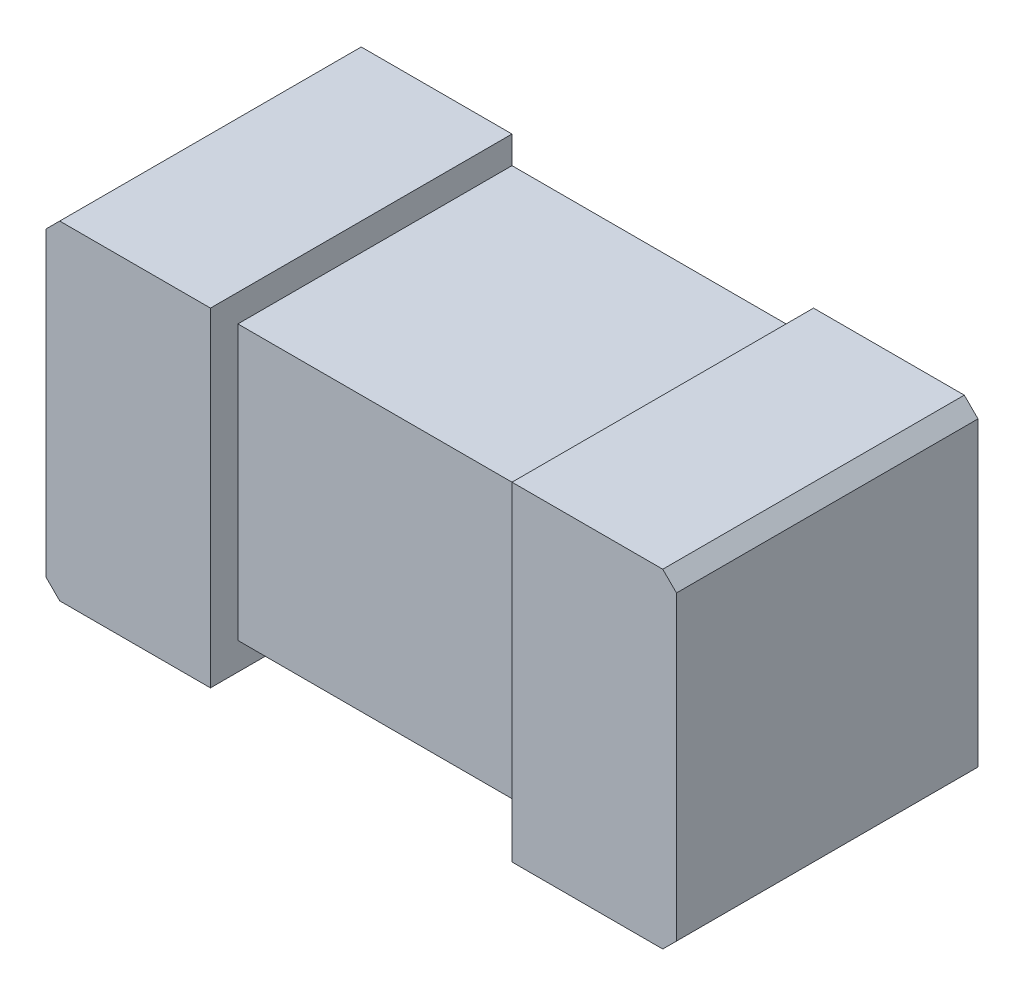
ISO-10303-21;
HEADER;
FILE_DESCRIPTION(('STEP AP214'),'2;1');
FILE_NAME('part.step','',(''),(''),'','','');
FILE_SCHEMA(('AUTOMOTIVE_DESIGN { 1 0 10303 214 1 1 1 1 }'));
ENDSEC;
DATA;
#1=APPLICATION_CONTEXT('core data for automotive mechanical design processes');
#2=APPLICATION_PROTOCOL_DEFINITION('international standard','automotive_design',2000,#1);
#3=PRODUCT_CONTEXT('',#1,'mechanical');
#4=PRODUCT('Part','Part','',(#3));
#5=PRODUCT_RELATED_PRODUCT_CATEGORY('part','',(#4));
#6=PRODUCT_DEFINITION_FORMATION('','',#4);
#7=PRODUCT_DEFINITION_CONTEXT('part definition',#1,'design');
#8=PRODUCT_DEFINITION('design','',#6,#7);
#9=PRODUCT_DEFINITION_SHAPE('','',#8);
#10=(LENGTH_UNIT() NAMED_UNIT(*) SI_UNIT(.MILLI.,.METRE.));
#11=(NAMED_UNIT(*) PLANE_ANGLE_UNIT() SI_UNIT($,.RADIAN.));
#12=(NAMED_UNIT(*) SI_UNIT($,.STERADIAN.) SOLID_ANGLE_UNIT());
#13=UNCERTAINTY_MEASURE_WITH_UNIT(LENGTH_MEASURE(1.E-05),#10,'distance_accuracy_value','');
#14=(GEOMETRIC_REPRESENTATION_CONTEXT(3) GLOBAL_UNCERTAINTY_ASSIGNED_CONTEXT((#13)) GLOBAL_UNIT_ASSIGNED_CONTEXT((#10,
#11,#12)) REPRESENTATION_CONTEXT('',''));
#15=CARTESIAN_POINT('',(0.,0.,0.));
#16=DIRECTION('',(0.,0.,1.));
#17=DIRECTION('',(1.,0.,0.));
#18=AXIS2_PLACEMENT_3D('',#15,#16,#17);
#19=CARTESIAN_POINT('',(0.,0.85,0.55));
#20=DIRECTION('',(0.,0.,1.));
#21=DIRECTION('',(1.,0.,0.));
#22=AXIS2_PLACEMENT_3D('',#19,#20,#21);
#23=PLANE('',#22);
#24=DIRECTION('',(0.,1.,0.));
#25=VECTOR('',#24,1.);
#26=CARTESIAN_POINT('',(0.275,0.25,0.55));
#27=LINE('',#26,#25);
#28=CARTESIAN_POINT('',(0.275,-0.3,0.55));
#29=VERTEX_POINT('',#28);
#30=CARTESIAN_POINT('',(0.275,0.3,0.55));
#31=VERTEX_POINT('',#30);
#32=EDGE_CURVE('E43',#29,#31,#27,.T.);
#33=ORIENTED_EDGE('',*,*,#32,.F.);
#34=DIRECTION('',(1.,0.,0.));
#35=VECTOR('',#34,1.);
#36=CARTESIAN_POINT('',(-0.55,-0.3,0.55));
#37=LINE('',#36,#35);
#38=CARTESIAN_POINT('',(0.55,-0.3,0.55));
#39=VERTEX_POINT('',#38);
#40=EDGE_CURVE('E11',#29,#39,#37,.T.);
#41=ORIENTED_EDGE('',*,*,#40,.T.);
#42=DIRECTION('',(0.707106781186548,0.707106781186548,0.));
#43=VECTOR('',#42,1.);
#44=CARTESIAN_POINT('',(0.55,-0.3,0.55));
#45=LINE('',#44,#43);
#46=CARTESIAN_POINT('',(0.575,-0.275,0.55));
#47=VERTEX_POINT('',#46);
#48=EDGE_CURVE('E29',#39,#47,#45,.T.);
#49=ORIENTED_EDGE('',*,*,#48,.T.);
#50=DIRECTION('',(0.,1.,0.));
#51=VECTOR('',#50,1.);
#52=CARTESIAN_POINT('',(0.575,-0.275,0.55));
#53=LINE('',#52,#51);
#54=CARTESIAN_POINT('',(0.575,0.275,0.55));
#55=VERTEX_POINT('',#54);
#56=EDGE_CURVE('E247',#47,#55,#53,.T.);
#57=ORIENTED_EDGE('',*,*,#56,.T.);
#58=DIRECTION('',(-0.707106781186548,0.707106781186548,0.));
#59=VECTOR('',#58,1.);
#60=CARTESIAN_POINT('',(0.575,0.275,0.55));
#61=LINE('',#60,#59);
#62=CARTESIAN_POINT('',(0.55,0.3,0.55));
#63=VERTEX_POINT('',#62);
#64=EDGE_CURVE('E252',#55,#63,#61,.T.);
#65=ORIENTED_EDGE('',*,*,#64,.T.);
#66=DIRECTION('',(-1.,0.,0.));
#67=VECTOR('',#66,1.);
#68=CARTESIAN_POINT('',(0.55,0.3,0.55));
#69=LINE('',#68,#67);
#70=EDGE_CURVE('E154',#63,#31,#69,.T.);
#71=ORIENTED_EDGE('',*,*,#70,.T.);
#72=EDGE_LOOP('',(#33,#41,#49,#57,#65,#71));
#73=FACE_BOUND('',#72,.T.);
#74=ADVANCED_FACE('F18',(#73),#23,.T.);
#75=CARTESIAN_POINT('',(-0.55,-0.3,0.55));
#76=DIRECTION('',(0.,1.,0.));
#77=DIRECTION('',(1.,0.,0.));
#78=AXIS2_PLACEMENT_3D('',#75,#76,#77);
#79=PLANE('',#78);
#80=DIRECTION('',(1.,0.,0.));
#81=VECTOR('',#80,1.);
#82=CARTESIAN_POINT('',(-0.55,-0.3,0.));
#83=LINE('',#82,#81);
#84=CARTESIAN_POINT('',(-0.55,-0.3,0.));
#85=VERTEX_POINT('',#84);
#86=CARTESIAN_POINT('',(-0.275,-0.3,0.));
#87=VERTEX_POINT('',#86);
#88=EDGE_CURVE('E262',#85,#87,#83,.T.);
#89=ORIENTED_EDGE('',*,*,#88,.T.);
#90=DIRECTION('',(0.,0.,1.));
#91=VECTOR('',#90,1.);
#92=CARTESIAN_POINT('',(-0.275,-0.3,-9.45));
#93=LINE('',#92,#91);
#94=CARTESIAN_POINT('',(-0.275,-0.3,0.55));
#95=VERTEX_POINT('',#94);
#96=EDGE_CURVE('E240',#87,#95,#93,.T.);
#97=ORIENTED_EDGE('',*,*,#96,.T.);
#98=DIRECTION('',(1.,0.,0.));
#99=VECTOR('',#98,1.);
#100=CARTESIAN_POINT('',(-0.55,-0.3,0.55));
#101=LINE('',#100,#99);
#102=CARTESIAN_POINT('',(-0.55,-0.3,0.55));
#103=VERTEX_POINT('',#102);
#104=EDGE_CURVE('E241',#103,#95,#101,.T.);
#105=ORIENTED_EDGE('',*,*,#104,.F.);
#106=DIRECTION('',(0.,0.,-1.));
#107=VECTOR('',#106,1.);
#108=CARTESIAN_POINT('',(-0.55,-0.3,0.55));
#109=LINE('',#108,#107);
#110=EDGE_CURVE('E227',#103,#85,#109,.T.);
#111=ORIENTED_EDGE('',*,*,#110,.T.);
#112=EDGE_LOOP('',(#89,#97,#105,#111));
#113=FACE_BOUND('',#112,.T.);
#114=ADVANCED_FACE('F405',(#113),#79,.F.);
#115=CARTESIAN_POINT('',(0.55,0.3,0.55));
#116=DIRECTION('',(0.,-1.,0.));
#117=DIRECTION('',(0.,0.,-1.));
#118=AXIS2_PLACEMENT_3D('',#115,#116,#117);
#119=PLANE('',#118);
#120=DIRECTION('',(-1.,0.,0.));
#121=VECTOR('',#120,1.);
#122=CARTESIAN_POINT('',(0.55,0.3,0.));
#123=LINE('',#122,#121);
#124=CARTESIAN_POINT('',(0.55,0.3,0.));
#125=VERTEX_POINT('',#124);
#126=CARTESIAN_POINT('',(0.275,0.3,0.));
#127=VERTEX_POINT('',#126);
#128=EDGE_CURVE('E223',#125,#127,#123,.T.);
#129=ORIENTED_EDGE('',*,*,#128,.T.);
#130=DIRECTION('',(0.,0.,1.));
#131=VECTOR('',#130,1.);
#132=CARTESIAN_POINT('',(0.275,0.3,-9.45));
#133=LINE('',#132,#131);
#134=EDGE_CURVE('E228',#127,#31,#133,.T.);
#135=ORIENTED_EDGE('',*,*,#134,.T.);
#136=ORIENTED_EDGE('',*,*,#70,.F.);
#137=DIRECTION('',(0.,0.,-1.));
#138=VECTOR('',#137,1.);
#139=CARTESIAN_POINT('',(0.55,0.3,0.55));
#140=LINE('',#139,#138);
#141=EDGE_CURVE('E216',#63,#125,#140,.T.);
#142=ORIENTED_EDGE('',*,*,#141,.T.);
#143=EDGE_LOOP('',(#129,#135,#136,#142));
#144=FACE_BOUND('',#143,.T.);
#145=ADVANCED_FACE('F403',(#144),#119,.F.);
#146=CARTESIAN_POINT('',(0.575,0.275,0.55));
#147=DIRECTION('',(-0.707106781186548,-0.707106781186548,0.));
#148=DIRECTION('',(-0.707106781186548,0.707106781186548,0.));
#149=AXIS2_PLACEMENT_3D('',#146,#147,#148);
#150=PLANE('',#149);
#151=DIRECTION('',(-0.707106781186548,0.707106781186548,0.));
#152=VECTOR('',#151,1.);
#153=CARTESIAN_POINT('',(0.575,0.275,0.));
#154=LINE('',#153,#152);
#155=CARTESIAN_POINT('',(0.575,0.275,0.));
#156=VERTEX_POINT('',#155);
#157=EDGE_CURVE('E213',#156,#125,#154,.T.);
#158=ORIENTED_EDGE('',*,*,#157,.T.);
#159=ORIENTED_EDGE('',*,*,#141,.F.);
#160=ORIENTED_EDGE('',*,*,#64,.F.);
#161=DIRECTION('',(0.,0.,-1.));
#162=VECTOR('',#161,1.);
#163=CARTESIAN_POINT('',(0.575,0.275,0.55));
#164=LINE('',#163,#162);
#165=EDGE_CURVE('E217',#55,#156,#164,.T.);
#166=ORIENTED_EDGE('',*,*,#165,.T.);
#167=EDGE_LOOP('',(#158,#159,#160,#166));
#168=FACE_BOUND('',#167,.T.);
#169=ADVANCED_FACE('F402',(#168),#150,.F.);
#170=CARTESIAN_POINT('',(0.55,0.3,0.55));
#171=DIRECTION('',(0.,-1.,0.));
#172=DIRECTION('',(0.,0.,-1.));
#173=AXIS2_PLACEMENT_3D('',#170,#171,#172);
#174=PLANE('',#173);
#175=DIRECTION('',(-1.,0.,0.));
#176=VECTOR('',#175,1.);
#177=CARTESIAN_POINT('',(0.55,0.3,0.55));
#178=LINE('',#177,#176);
#179=CARTESIAN_POINT('',(-0.275,0.3,0.55));
#180=VERTEX_POINT('',#179);
#181=CARTESIAN_POINT('',(-0.55,0.3,0.55));
#182=VERTEX_POINT('',#181);
#183=EDGE_CURVE('E178',#180,#182,#178,.T.);
#184=ORIENTED_EDGE('',*,*,#183,.F.);
#185=DIRECTION('',(0.,0.,1.));
#186=VECTOR('',#185,1.);
#187=CARTESIAN_POINT('',(-0.275,0.3,-9.45));
#188=LINE('',#187,#186);
#189=CARTESIAN_POINT('',(-0.275,0.3,0.));
#190=VERTEX_POINT('',#189);
#191=EDGE_CURVE('E268',#190,#180,#188,.T.);
#192=ORIENTED_EDGE('',*,*,#191,.F.);
#193=DIRECTION('',(-1.,0.,0.));
#194=VECTOR('',#193,1.);
#195=CARTESIAN_POINT('',(0.55,0.3,0.));
#196=LINE('',#195,#194);
#197=CARTESIAN_POINT('',(-0.55,0.3,0.));
#198=VERTEX_POINT('',#197);
#199=EDGE_CURVE('E229',#190,#198,#196,.T.);
#200=ORIENTED_EDGE('',*,*,#199,.T.);
#201=DIRECTION('',(0.,0.,-1.));
#202=VECTOR('',#201,1.);
#203=CARTESIAN_POINT('',(-0.55,0.3,0.55));
#204=LINE('',#203,#202);
#205=EDGE_CURVE('E249',#182,#198,#204,.T.);
#206=ORIENTED_EDGE('',*,*,#205,.F.);
#207=EDGE_LOOP('',(#184,#192,#200,#206));
#208=FACE_BOUND('',#207,.T.);
#209=ADVANCED_FACE('F412',(#208),#174,.F.);
#210=CARTESIAN_POINT('',(-0.55,0.3,0.55));
#211=DIRECTION('',(0.707106781186548,-0.707106781186548,0.));
#212=DIRECTION('',(0.,0.,-1.));
#213=AXIS2_PLACEMENT_3D('',#210,#211,#212);
#214=PLANE('',#213);
#215=DIRECTION('',(-0.707106781186548,-0.707106781186548,0.));
#216=VECTOR('',#215,1.);
#217=CARTESIAN_POINT('',(-0.55,0.3,0.));
#218=LINE('',#217,#216);
#219=CARTESIAN_POINT('',(-0.575,0.275,0.));
#220=VERTEX_POINT('',#219);
#221=EDGE_CURVE('E187',#198,#220,#218,.T.);
#222=ORIENTED_EDGE('',*,*,#221,.T.);
#223=DIRECTION('',(0.,0.,-1.));
#224=VECTOR('',#223,1.);
#225=CARTESIAN_POINT('',(-0.575,0.275,0.55));
#226=LINE('',#225,#224);
#227=CARTESIAN_POINT('',(-0.575,0.275,0.55));
#228=VERTEX_POINT('',#227);
#229=EDGE_CURVE('E184',#228,#220,#226,.T.);
#230=ORIENTED_EDGE('',*,*,#229,.F.);
#231=DIRECTION('',(-0.707106781186548,-0.707106781186548,0.));
#232=VECTOR('',#231,1.);
#233=CARTESIAN_POINT('',(-0.55,0.3,0.55));
#234=LINE('',#233,#232);
#235=EDGE_CURVE('E170',#182,#228,#234,.T.);
#236=ORIENTED_EDGE('',*,*,#235,.F.);
#237=ORIENTED_EDGE('',*,*,#205,.T.);
#238=EDGE_LOOP('',(#222,#230,#236,#237));
#239=FACE_BOUND('',#238,.T.);
#240=ADVANCED_FACE('F185',(#239),#214,.F.);
#241=CARTESIAN_POINT('',(-0.575,0.275,0.55));
#242=DIRECTION('',(1.,0.,0.));
#243=DIRECTION('',(0.,1.,0.));
#244=AXIS2_PLACEMENT_3D('',#241,#242,#243);
#245=PLANE('',#244);
#246=DIRECTION('',(0.,-1.,0.));
#247=VECTOR('',#246,1.);
#248=CARTESIAN_POINT('',(-0.575,0.275,0.));
#249=LINE('',#248,#247);
#250=CARTESIAN_POINT('',(-0.575,-0.275,0.));
#251=VERTEX_POINT('',#250);
#252=EDGE_CURVE('E192',#220,#251,#249,.T.);
#253=ORIENTED_EDGE('',*,*,#252,.T.);
#254=DIRECTION('',(0.,0.,-1.));
#255=VECTOR('',#254,1.);
#256=CARTESIAN_POINT('',(-0.575,-0.275,0.55));
#257=LINE('',#256,#255);
#258=CARTESIAN_POINT('',(-0.575,-0.275,0.55));
#259=VERTEX_POINT('',#258);
#260=EDGE_CURVE('E196',#259,#251,#257,.T.);
#261=ORIENTED_EDGE('',*,*,#260,.F.);
#262=DIRECTION('',(0.,-1.,0.));
#263=VECTOR('',#262,1.);
#264=CARTESIAN_POINT('',(-0.575,0.275,0.55));
#265=LINE('',#264,#263);
#266=EDGE_CURVE('E174',#228,#259,#265,.T.);
#267=ORIENTED_EDGE('',*,*,#266,.F.);
#268=ORIENTED_EDGE('',*,*,#229,.T.);
#269=EDGE_LOOP('',(#253,#261,#267,#268));
#270=FACE_BOUND('',#269,.T.);
#271=ADVANCED_FACE('F195',(#270),#245,.F.);
#272=CARTESIAN_POINT('',(-0.575,-0.275,0.55));
#273=DIRECTION('',(0.707106781186548,0.707106781186548,0.));
#274=DIRECTION('',(0.,0.,-1.));
#275=AXIS2_PLACEMENT_3D('',#272,#273,#274);
#276=PLANE('',#275);
#277=DIRECTION('',(0.707106781186548,-0.707106781186548,0.));
#278=VECTOR('',#277,1.);
#279=CARTESIAN_POINT('',(-0.575,-0.275,0.));
#280=LINE('',#279,#278);
#281=EDGE_CURVE('E193',#251,#85,#280,.T.);
#282=ORIENTED_EDGE('',*,*,#281,.T.);
#283=ORIENTED_EDGE('',*,*,#110,.F.);
#284=DIRECTION('',(0.707106781186548,-0.707106781186548,0.));
#285=VECTOR('',#284,1.);
#286=CARTESIAN_POINT('',(-0.575,-0.275,0.55));
#287=LINE('',#286,#285);
#288=EDGE_CURVE('E199',#259,#103,#287,.T.);
#289=ORIENTED_EDGE('',*,*,#288,.F.);
#290=ORIENTED_EDGE('',*,*,#260,.T.);
#291=EDGE_LOOP('',(#282,#283,#289,#290));
#292=FACE_BOUND('',#291,.T.);
#293=ADVANCED_FACE('F382',(#292),#276,.F.);
#294=CARTESIAN_POINT('',(-0.55,-0.3,0.55));
#295=DIRECTION('',(0.,1.,0.));
#296=DIRECTION('',(1.,0.,0.));
#297=AXIS2_PLACEMENT_3D('',#294,#295,#296);
#298=PLANE('',#297);
#299=ORIENTED_EDGE('',*,*,#40,.F.);
#300=DIRECTION('',(0.,0.,1.));
#301=VECTOR('',#300,1.);
#302=CARTESIAN_POINT('',(0.275,-0.3,-9.45));
#303=LINE('',#302,#301);
#304=CARTESIAN_POINT('',(0.275,-0.3,0.));
#305=VERTEX_POINT('',#304);
#306=EDGE_CURVE('E221',#305,#29,#303,.T.);
#307=ORIENTED_EDGE('',*,*,#306,.F.);
#308=DIRECTION('',(1.,0.,0.));
#309=VECTOR('',#308,1.);
#310=CARTESIAN_POINT('',(-0.55,-0.3,0.));
#311=LINE('',#310,#309);
#312=CARTESIAN_POINT('',(0.55,-0.3,0.));
#313=VERTEX_POINT('',#312);
#314=EDGE_CURVE('E299',#305,#313,#311,.T.);
#315=ORIENTED_EDGE('',*,*,#314,.T.);
#316=DIRECTION('',(0.,0.,-1.));
#317=VECTOR('',#316,1.);
#318=CARTESIAN_POINT('',(0.55,-0.3,0.55));
#319=LINE('',#318,#317);
#320=EDGE_CURVE('E22',#39,#313,#319,.T.);
#321=ORIENTED_EDGE('',*,*,#320,.F.);
#322=EDGE_LOOP('',(#299,#307,#315,#321));
#323=FACE_BOUND('',#322,.T.);
#324=ADVANCED_FACE('F350',(#323),#298,.F.);
#325=CARTESIAN_POINT('',(0.55,-0.3,0.55));
#326=DIRECTION('',(-0.707106781186548,0.707106781186548,0.));
#327=DIRECTION('',(0.,0.,1.));
#328=AXIS2_PLACEMENT_3D('',#325,#326,#327);
#329=PLANE('',#328);
#330=DIRECTION('',(0.707106781186548,0.707106781186548,0.));
#331=VECTOR('',#330,1.);
#332=CARTESIAN_POINT('',(0.55,-0.3,0.));
#333=LINE('',#332,#331);
#334=CARTESIAN_POINT('',(0.575,-0.275,0.));
#335=VERTEX_POINT('',#334);
#336=EDGE_CURVE('E300',#313,#335,#333,.T.);
#337=ORIENTED_EDGE('',*,*,#336,.T.);
#338=DIRECTION('',(0.,0.,-1.));
#339=VECTOR('',#338,1.);
#340=CARTESIAN_POINT('',(0.575,-0.275,0.55));
#341=LINE('',#340,#339);
#342=EDGE_CURVE('E244',#47,#335,#341,.T.);
#343=ORIENTED_EDGE('',*,*,#342,.F.);
#344=ORIENTED_EDGE('',*,*,#48,.F.);
#345=ORIENTED_EDGE('',*,*,#320,.T.);
#346=EDGE_LOOP('',(#337,#343,#344,#345));
#347=FACE_BOUND('',#346,.T.);
#348=ADVANCED_FACE('F358',(#347),#329,.F.);
#349=CARTESIAN_POINT('',(0.575,-0.275,0.55));
#350=DIRECTION('',(-1.,0.,0.));
#351=DIRECTION('',(0.,0.,1.));
#352=AXIS2_PLACEMENT_3D('',#349,#350,#351);
#353=PLANE('',#352);
#354=DIRECTION('',(0.,1.,0.));
#355=VECTOR('',#354,1.);
#356=CARTESIAN_POINT('',(0.575,-0.275,0.));
#357=LINE('',#356,#355);
#358=EDGE_CURVE('E285',#335,#156,#357,.T.);
#359=ORIENTED_EDGE('',*,*,#358,.T.);
#360=ORIENTED_EDGE('',*,*,#165,.F.);
#361=ORIENTED_EDGE('',*,*,#56,.F.);
#362=ORIENTED_EDGE('',*,*,#342,.T.);
#363=EDGE_LOOP('',(#359,#360,#361,#362));
#364=FACE_BOUND('',#363,.T.);
#365=ADVANCED_FACE('F363',(#364),#353,.F.);
#366=CARTESIAN_POINT('',(0.,0.85,0.55));
#367=DIRECTION('',(0.,0.,1.));
#368=DIRECTION('',(1.,0.,0.));
#369=AXIS2_PLACEMENT_3D('',#366,#367,#368);
#370=PLANE('',#369);
#371=ORIENTED_EDGE('',*,*,#104,.T.);
#372=DIRECTION('',(0.,-1.,0.));
#373=VECTOR('',#372,1.);
#374=CARTESIAN_POINT('',(-0.275,0.3,0.55));
#375=LINE('',#374,#373);
#376=EDGE_CURVE('E272',#180,#95,#375,.T.);
#377=ORIENTED_EDGE('',*,*,#376,.F.);
#378=ORIENTED_EDGE('',*,*,#183,.T.);
#379=ORIENTED_EDGE('',*,*,#235,.T.);
#380=ORIENTED_EDGE('',*,*,#266,.T.);
#381=ORIENTED_EDGE('',*,*,#288,.T.);
#382=EDGE_LOOP('',(#371,#377,#378,#379,#380,#381));
#383=FACE_BOUND('',#382,.T.);
#384=ADVANCED_FACE('F20',(#383),#370,.T.);
#385=CARTESIAN_POINT('',(0.,0.85,0.));
#386=DIRECTION('',(0.,0.,1.));
#387=DIRECTION('',(1.,0.,0.));
#388=AXIS2_PLACEMENT_3D('',#385,#386,#387);
#389=PLANE('',#388);
#390=DIRECTION('',(-1.,0.,0.));
#391=VECTOR('',#390,1.);
#392=CARTESIAN_POINT('',(0.,-0.25,0.));
#393=LINE('',#392,#391);
#394=CARTESIAN_POINT('',(0.275,-0.25,0.));
#395=VERTEX_POINT('',#394);
#396=CARTESIAN_POINT('',(-0.275,-0.25,0.));
#397=VERTEX_POINT('',#396);
#398=EDGE_CURVE('E205',#395,#397,#393,.T.);
#399=ORIENTED_EDGE('',*,*,#398,.T.);
#400=DIRECTION('',(0.,-1.,0.));
#401=VECTOR('',#400,1.);
#402=CARTESIAN_POINT('',(-0.275,0.85,0.));
#403=LINE('',#402,#401);
#404=EDGE_CURVE('E233',#397,#87,#403,.T.);
#405=ORIENTED_EDGE('',*,*,#404,.T.);
#406=ORIENTED_EDGE('',*,*,#88,.F.);
#407=ORIENTED_EDGE('',*,*,#281,.F.);
#408=ORIENTED_EDGE('',*,*,#252,.F.);
#409=ORIENTED_EDGE('',*,*,#221,.F.);
#410=ORIENTED_EDGE('',*,*,#199,.F.);
#411=DIRECTION('',(0.,-1.,0.));
#412=VECTOR('',#411,1.);
#413=CARTESIAN_POINT('',(-0.275,0.85,0.));
#414=LINE('',#413,#412);
#415=CARTESIAN_POINT('',(-0.275,0.25,0.));
#416=VERTEX_POINT('',#415);
#417=EDGE_CURVE('E237',#190,#416,#414,.T.);
#418=ORIENTED_EDGE('',*,*,#417,.T.);
#419=DIRECTION('',(1.,0.,0.));
#420=VECTOR('',#419,1.);
#421=CARTESIAN_POINT('',(0.,0.25,0.));
#422=LINE('',#421,#420);
#423=CARTESIAN_POINT('',(0.275,0.25,0.));
#424=VERTEX_POINT('',#423);
#425=EDGE_CURVE('E273',#416,#424,#422,.T.);
#426=ORIENTED_EDGE('',*,*,#425,.T.);
#427=DIRECTION('',(0.,1.,0.));
#428=VECTOR('',#427,1.);
#429=CARTESIAN_POINT('',(0.275,0.85,0.));
#430=LINE('',#429,#428);
#431=EDGE_CURVE('E277',#424,#127,#430,.T.);
#432=ORIENTED_EDGE('',*,*,#431,.T.);
#433=ORIENTED_EDGE('',*,*,#128,.F.);
#434=ORIENTED_EDGE('',*,*,#157,.F.);
#435=ORIENTED_EDGE('',*,*,#358,.F.);
#436=ORIENTED_EDGE('',*,*,#336,.F.);
#437=ORIENTED_EDGE('',*,*,#314,.F.);
#438=DIRECTION('',(0.,1.,0.));
#439=VECTOR('',#438,1.);
#440=CARTESIAN_POINT('',(0.275,0.85,0.));
#441=LINE('',#440,#439);
#442=EDGE_CURVE('E309',#305,#395,#441,.T.);
#443=ORIENTED_EDGE('',*,*,#442,.T.);
#444=EDGE_LOOP('',(#399,#405,#406,#407,#408,#409,#410,#418,#426,#432,#433,#434,#435,#436,#437,#443));
#445=FACE_BOUND('',#444,.T.);
#446=ADVANCED_FACE('F354',(#445),#389,.F.);
#447=CARTESIAN_POINT('',(0.275,0.25,-9.45));
#448=DIRECTION('',(1.,0.,0.));
#449=DIRECTION('',(0.,1.,0.));
#450=AXIS2_PLACEMENT_3D('',#447,#448,#449);
#451=PLANE('',#450);
#452=DIRECTION('',(0.,0.,1.));
#453=VECTOR('',#452,1.);
#454=CARTESIAN_POINT('',(0.275,0.25,-9.45));
#455=LINE('',#454,#453);
#456=CARTESIAN_POINT('',(0.275,0.25,0.5));
#457=VERTEX_POINT('',#456);
#458=EDGE_CURVE('E284',#424,#457,#455,.T.);
#459=ORIENTED_EDGE('',*,*,#458,.T.);
#460=DIRECTION('',(0.,-1.,0.));
#461=VECTOR('',#460,1.);
#462=CARTESIAN_POINT('',(0.275,9.75,0.5));
#463=LINE('',#462,#461);
#464=CARTESIAN_POINT('',(0.275,-0.25,0.5));
#465=VERTEX_POINT('',#464);
#466=EDGE_CURVE('E267',#457,#465,#463,.T.);
#467=ORIENTED_EDGE('',*,*,#466,.T.);
#468=DIRECTION('',(0.,0.,1.));
#469=VECTOR('',#468,1.);
#470=CARTESIAN_POINT('',(0.275,-0.25,-9.45));
#471=LINE('',#470,#469);
#472=EDGE_CURVE('E317',#395,#465,#471,.T.);
#473=ORIENTED_EDGE('',*,*,#472,.F.);
#474=ORIENTED_EDGE('',*,*,#442,.F.);
#475=ORIENTED_EDGE('',*,*,#306,.T.);
#476=ORIENTED_EDGE('',*,*,#32,.T.);
#477=ORIENTED_EDGE('',*,*,#134,.F.);
#478=ORIENTED_EDGE('',*,*,#431,.F.);
#479=EDGE_LOOP('',(#459,#467,#473,#474,#475,#476,#477,#478));
#480=FACE_BOUND('',#479,.T.);
#481=ADVANCED_FACE('F365',(#480),#451,.F.);
#482=CARTESIAN_POINT('',(0.275,0.25,-9.45));
#483=DIRECTION('',(0.,-1.,0.));
#484=DIRECTION('',(0.,0.,-1.));
#485=AXIS2_PLACEMENT_3D('',#482,#483,#484);
#486=PLANE('',#485);
#487=DIRECTION('',(0.,0.,1.));
#488=VECTOR('',#487,1.);
#489=CARTESIAN_POINT('',(-0.275,0.25,-9.45));
#490=LINE('',#489,#488);
#491=CARTESIAN_POINT('',(-0.275,0.25,0.5));
#492=VERTEX_POINT('',#491);
#493=EDGE_CURVE('E222',#416,#492,#490,.T.);
#494=ORIENTED_EDGE('',*,*,#493,.T.);
#495=DIRECTION('',(1.,0.,0.));
#496=VECTOR('',#495,1.);
#497=CARTESIAN_POINT('',(0.275,0.25,0.5));
#498=LINE('',#497,#496);
#499=EDGE_CURVE('E271',#492,#457,#498,.T.);
#500=ORIENTED_EDGE('',*,*,#499,.T.);
#501=ORIENTED_EDGE('',*,*,#458,.F.);
#502=ORIENTED_EDGE('',*,*,#425,.F.);
#503=EDGE_LOOP('',(#494,#500,#501,#502));
#504=FACE_BOUND('',#503,.T.);
#505=ADVANCED_FACE('F389',(#504),#486,.F.);
#506=CARTESIAN_POINT('',(-0.275,0.3,-9.45));
#507=DIRECTION('',(-1.,0.,0.));
#508=DIRECTION('',(0.,0.,1.));
#509=AXIS2_PLACEMENT_3D('',#506,#507,#508);
#510=PLANE('',#509);
#511=ORIENTED_EDGE('',*,*,#191,.T.);
#512=ORIENTED_EDGE('',*,*,#376,.T.);
#513=ORIENTED_EDGE('',*,*,#96,.F.);
#514=ORIENTED_EDGE('',*,*,#404,.F.);
#515=DIRECTION('',(0.,0.,1.));
#516=VECTOR('',#515,1.);
#517=CARTESIAN_POINT('',(-0.275,-0.25,-9.45));
#518=LINE('',#517,#516);
#519=CARTESIAN_POINT('',(-0.275,-0.25,0.5));
#520=VERTEX_POINT('',#519);
#521=EDGE_CURVE('E313',#397,#520,#518,.T.);
#522=ORIENTED_EDGE('',*,*,#521,.T.);
#523=DIRECTION('',(0.,-1.,0.));
#524=VECTOR('',#523,1.);
#525=CARTESIAN_POINT('',(-0.275,9.75,0.5));
#526=LINE('',#525,#524);
#527=EDGE_CURVE('E318',#492,#520,#526,.T.);
#528=ORIENTED_EDGE('',*,*,#527,.F.);
#529=ORIENTED_EDGE('',*,*,#493,.F.);
#530=ORIENTED_EDGE('',*,*,#417,.F.);
#531=EDGE_LOOP('',(#511,#512,#513,#514,#522,#528,#529,#530));
#532=FACE_BOUND('',#531,.T.);
#533=ADVANCED_FACE('F374',(#532),#510,.F.);
#534=CARTESIAN_POINT('',(-0.275,-0.25,-9.45));
#535=DIRECTION('',(0.,1.,0.));
#536=DIRECTION('',(1.,0.,0.));
#537=AXIS2_PLACEMENT_3D('',#534,#535,#536);
#538=PLANE('',#537);
#539=ORIENTED_EDGE('',*,*,#472,.T.);
#540=DIRECTION('',(1.,0.,0.));
#541=VECTOR('',#540,1.);
#542=CARTESIAN_POINT('',(0.275,-0.25,0.5));
#543=LINE('',#542,#541);
#544=EDGE_CURVE('E321',#520,#465,#543,.T.);
#545=ORIENTED_EDGE('',*,*,#544,.F.);
#546=ORIENTED_EDGE('',*,*,#521,.F.);
#547=ORIENTED_EDGE('',*,*,#398,.F.);
#548=EDGE_LOOP('',(#539,#545,#546,#547));
#549=FACE_BOUND('',#548,.T.);
#550=ADVANCED_FACE('F370',(#549),#538,.F.);
#551=CARTESIAN_POINT('',(0.275,9.75,0.5));
#552=DIRECTION('',(0.,0.,-1.));
#553=DIRECTION('',(0.,-1.,0.));
#554=AXIS2_PLACEMENT_3D('',#551,#552,#553);
#555=PLANE('',#554);
#556=ORIENTED_EDGE('',*,*,#527,.T.);
#557=ORIENTED_EDGE('',*,*,#544,.T.);
#558=ORIENTED_EDGE('',*,*,#466,.F.);
#559=ORIENTED_EDGE('',*,*,#499,.F.);
#560=EDGE_LOOP('',(#556,#557,#558,#559));
#561=FACE_BOUND('',#560,.T.);
#562=ADVANCED_FACE('F398',(#561),#555,.F.);
#563=CLOSED_SHELL('',(#74,#114,#145,#169,#209,#240,#271,#293,#324,#348,#365,#384,#446,#481,#505,
#533,#550,#562));
#564=MANIFOLD_SOLID_BREP('B1',#563);
#565=ADVANCED_BREP_SHAPE_REPRESENTATION('',(#18,#564),#14);
#566=SHAPE_DEFINITION_REPRESENTATION(#9,#565);
ENDSEC;
END-ISO-10303-21;
